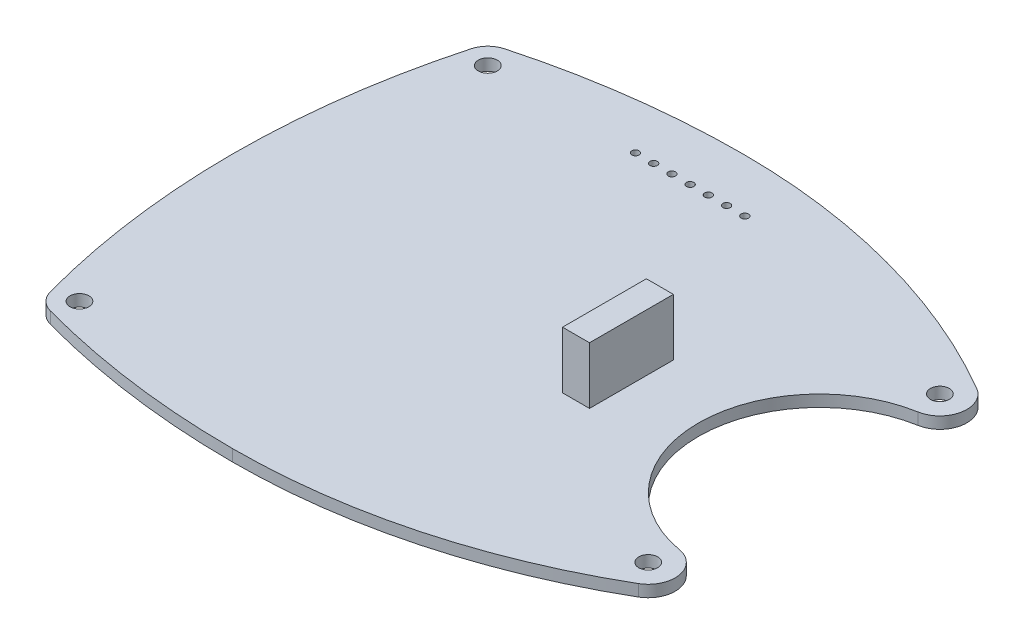
ISO-10303-21;
HEADER;
FILE_DESCRIPTION(('STEP AP214'),'2;1');
FILE_NAME('part.step','',(''),(''),'','','');
FILE_SCHEMA(('AUTOMOTIVE_DESIGN { 1 0 10303 214 1 1 1 1 }'));
ENDSEC;
DATA;
#1=APPLICATION_CONTEXT('core data for automotive mechanical design processes');
#2=APPLICATION_PROTOCOL_DEFINITION('international standard','automotive_design',2000,#1);
#3=PRODUCT_CONTEXT('',#1,'mechanical');
#4=PRODUCT('Part','Part','',(#3));
#5=PRODUCT_RELATED_PRODUCT_CATEGORY('part','',(#4));
#6=PRODUCT_DEFINITION_FORMATION('','',#4);
#7=PRODUCT_DEFINITION_CONTEXT('part definition',#1,'design');
#8=PRODUCT_DEFINITION('design','',#6,#7);
#9=PRODUCT_DEFINITION_SHAPE('','',#8);
#10=(LENGTH_UNIT() NAMED_UNIT(*) SI_UNIT(.MILLI.,.METRE.));
#11=(NAMED_UNIT(*) PLANE_ANGLE_UNIT() SI_UNIT($,.RADIAN.));
#12=(NAMED_UNIT(*) SI_UNIT($,.STERADIAN.) SOLID_ANGLE_UNIT());
#13=UNCERTAINTY_MEASURE_WITH_UNIT(LENGTH_MEASURE(1.E-05),#10,'distance_accuracy_value','');
#14=(GEOMETRIC_REPRESENTATION_CONTEXT(3) GLOBAL_UNCERTAINTY_ASSIGNED_CONTEXT((#13)) GLOBAL_UNIT_ASSIGNED_CONTEXT((#10,
#11,#12)) REPRESENTATION_CONTEXT('',''));
#15=CARTESIAN_POINT('',(0.,0.,0.));
#16=DIRECTION('',(0.,0.,1.));
#17=DIRECTION('',(1.,0.,0.));
#18=AXIS2_PLACEMENT_3D('',#15,#16,#17);
#19=CARTESIAN_POINT('',(0.,9.4,0.));
#20=DIRECTION('',(0.,-1.,0.));
#21=DIRECTION('',(0.,0.,-1.));
#22=AXIS2_PLACEMENT_3D('',#19,#20,#21);
#23=PLANE('',#22);
#24=DIRECTION('',(0.,0.,-1.));
#25=VECTOR('',#24,1.);
#26=CARTESIAN_POINT('',(16.,9.4,5.75));
#27=LINE('',#26,#25);
#28=CARTESIAN_POINT('',(16.,9.4,5.75));
#29=VERTEX_POINT('',#28);
#30=CARTESIAN_POINT('',(16.,9.4,-5.75));
#31=VERTEX_POINT('',#30);
#32=EDGE_CURVE('E215',#29,#31,#27,.T.);
#33=ORIENTED_EDGE('',*,*,#32,.F.);
#34=DIRECTION('',(-1.,0.,0.));
#35=VECTOR('',#34,1.);
#36=CARTESIAN_POINT('',(16.,9.4,5.75));
#37=LINE('',#36,#35);
#38=CARTESIAN_POINT('',(19.7,9.4,5.75));
#39=VERTEX_POINT('',#38);
#40=EDGE_CURVE('E220',#39,#29,#37,.T.);
#41=ORIENTED_EDGE('',*,*,#40,.F.);
#42=DIRECTION('',(0.,0.,1.));
#43=VECTOR('',#42,1.);
#44=CARTESIAN_POINT('',(19.7,9.4,5.75));
#45=LINE('',#44,#43);
#46=CARTESIAN_POINT('',(19.7,9.4,-5.75));
#47=VERTEX_POINT('',#46);
#48=EDGE_CURVE('E225',#47,#39,#45,.T.);
#49=ORIENTED_EDGE('',*,*,#48,.F.);
#50=DIRECTION('',(1.,0.,0.));
#51=VECTOR('',#50,1.);
#52=CARTESIAN_POINT('',(16.,9.4,-5.75));
#53=LINE('',#52,#51);
#54=EDGE_CURVE('E209',#31,#47,#53,.T.);
#55=ORIENTED_EDGE('',*,*,#54,.F.);
#56=EDGE_LOOP('',(#33,#41,#49,#55));
#57=FACE_BOUND('',#56,.T.);
#58=ADVANCED_FACE('F17',(#57),#23,.F.);
#59=CARTESIAN_POINT('',(0.,-3.,0.));
#60=DIRECTION('',(0.,1.,0.));
#61=DIRECTION('',(0.,0.,1.));
#62=AXIS2_PLACEMENT_3D('',#59,#60,#61);
#63=PLANE('',#62);
#64=DIRECTION('',(0.,0.,-1.));
#65=VECTOR('',#64,1.);
#66=CARTESIAN_POINT('',(11.002365618,-3.,-5.5));
#67=LINE('',#66,#65);
#68=CARTESIAN_POINT('',(11.002365618,-3.,-5.5));
#69=VERTEX_POINT('',#68);
#70=CARTESIAN_POINT('',(11.002365618,-3.,5.5));
#71=VERTEX_POINT('',#70);
#72=EDGE_CURVE('E166',#69,#71,#67,.F.);
#73=ORIENTED_EDGE('',*,*,#72,.F.);
#74=DIRECTION('',(1.,0.,0.));
#75=VECTOR('',#74,1.);
#76=CARTESIAN_POINT('',(11.002365618,-3.,-5.5));
#77=LINE('',#76,#75);
#78=CARTESIAN_POINT('',(16.002365618,-3.,-5.5));
#79=VERTEX_POINT('',#78);
#80=EDGE_CURVE('E178',#79,#69,#77,.F.);
#81=ORIENTED_EDGE('',*,*,#80,.F.);
#82=DIRECTION('',(0.,0.,1.));
#83=VECTOR('',#82,1.);
#84=CARTESIAN_POINT('',(16.002365618,-3.,-5.5));
#85=LINE('',#84,#83);
#86=CARTESIAN_POINT('',(16.002365618,-3.,5.5));
#87=VERTEX_POINT('',#86);
#88=EDGE_CURVE('E183',#87,#79,#85,.F.);
#89=ORIENTED_EDGE('',*,*,#88,.F.);
#90=DIRECTION('',(-1.,0.,0.));
#91=VECTOR('',#90,1.);
#92=CARTESIAN_POINT('',(11.002365618,-3.,5.5));
#93=LINE('',#92,#91);
#94=EDGE_CURVE('E149',#71,#87,#93,.F.);
#95=ORIENTED_EDGE('',*,*,#94,.F.);
#96=EDGE_LOOP('',(#73,#81,#89,#95));
#97=FACE_BOUND('',#96,.T.);
#98=ADVANCED_FACE('F473',(#97),#63,.F.);
#99=CARTESIAN_POINT('',(19.7,9.4,5.75));
#100=DIRECTION('',(-1.,0.,0.));
#101=DIRECTION('',(0.,0.,1.));
#102=AXIS2_PLACEMENT_3D('',#99,#100,#101);
#103=PLANE('',#102);
#104=ORIENTED_EDGE('',*,*,#48,.T.);
#105=DIRECTION('',(0.,1.,0.));
#106=VECTOR('',#105,1.);
#107=CARTESIAN_POINT('',(19.7,9.4,5.75));
#108=LINE('',#107,#106);
#109=CARTESIAN_POINT('',(19.7,1.6,5.75));
#110=VERTEX_POINT('',#109);
#111=EDGE_CURVE('E222',#110,#39,#108,.T.);
#112=ORIENTED_EDGE('',*,*,#111,.F.);
#113=DIRECTION('',(0.,0.,-1.));
#114=VECTOR('',#113,1.);
#115=CARTESIAN_POINT('',(19.7,1.6,-23.329166667));
#116=LINE('',#115,#114);
#117=CARTESIAN_POINT('',(19.7,1.6,-5.75));
#118=VERTEX_POINT('',#117);
#119=EDGE_CURVE('E174',#118,#110,#116,.F.);
#120=ORIENTED_EDGE('',*,*,#119,.F.);
#121=DIRECTION('',(0.,1.,0.));
#122=VECTOR('',#121,1.);
#123=CARTESIAN_POINT('',(19.7,9.4,-5.75));
#124=LINE('',#123,#122);
#125=EDGE_CURVE('E206',#47,#118,#124,.F.);
#126=ORIENTED_EDGE('',*,*,#125,.F.);
#127=EDGE_LOOP('',(#104,#112,#120,#126));
#128=FACE_BOUND('',#127,.T.);
#129=ADVANCED_FACE('F470',(#128),#103,.F.);
#130=CARTESIAN_POINT('',(16.,9.4,5.75));
#131=DIRECTION('',(0.,0.,-1.));
#132=DIRECTION('',(-1.,0.,0.));
#133=AXIS2_PLACEMENT_3D('',#130,#131,#132);
#134=PLANE('',#133);
#135=ORIENTED_EDGE('',*,*,#40,.T.);
#136=DIRECTION('',(0.,1.,0.));
#137=VECTOR('',#136,1.);
#138=CARTESIAN_POINT('',(16.,9.4,5.75));
#139=LINE('',#138,#137);
#140=CARTESIAN_POINT('',(16.,1.6,5.75));
#141=VERTEX_POINT('',#140);
#142=EDGE_CURVE('E217',#141,#29,#139,.T.);
#143=ORIENTED_EDGE('',*,*,#142,.F.);
#144=DIRECTION('',(1.,0.,0.));
#145=VECTOR('',#144,1.);
#146=CARTESIAN_POINT('',(-14.,1.6,5.75));
#147=LINE('',#146,#145);
#148=EDGE_CURVE('E498',#110,#141,#147,.F.);
#149=ORIENTED_EDGE('',*,*,#148,.F.);
#150=ORIENTED_EDGE('',*,*,#111,.T.);
#151=EDGE_LOOP('',(#135,#143,#149,#150));
#152=FACE_BOUND('',#151,.T.);
#153=ADVANCED_FACE('F466',(#152),#134,.F.);
#154=CARTESIAN_POINT('',(16.,9.4,5.75));
#155=DIRECTION('',(1.,0.,0.));
#156=DIRECTION('',(0.,0.,-1.));
#157=AXIS2_PLACEMENT_3D('',#154,#155,#156);
#158=PLANE('',#157);
#159=ORIENTED_EDGE('',*,*,#32,.T.);
#160=DIRECTION('',(0.,1.,0.));
#161=VECTOR('',#160,1.);
#162=CARTESIAN_POINT('',(16.,9.4,-5.75));
#163=LINE('',#162,#161);
#164=CARTESIAN_POINT('',(16.,1.6,-5.75));
#165=VERTEX_POINT('',#164);
#166=EDGE_CURVE('E212',#165,#31,#163,.T.);
#167=ORIENTED_EDGE('',*,*,#166,.F.);
#168=DIRECTION('',(0.,0.,-1.));
#169=VECTOR('',#168,1.);
#170=CARTESIAN_POINT('',(16.,1.6,-23.329166667));
#171=LINE('',#170,#169);
#172=EDGE_CURVE('E496',#141,#165,#171,.T.);
#173=ORIENTED_EDGE('',*,*,#172,.F.);
#174=ORIENTED_EDGE('',*,*,#142,.T.);
#175=EDGE_LOOP('',(#159,#167,#173,#174));
#176=FACE_BOUND('',#175,.T.);
#177=ADVANCED_FACE('F462',(#176),#158,.F.);
#178=CARTESIAN_POINT('',(16.,9.4,-5.75));
#179=DIRECTION('',(0.,0.,1.));
#180=DIRECTION('',(1.,0.,0.));
#181=AXIS2_PLACEMENT_3D('',#178,#179,#180);
#182=PLANE('',#181);
#183=ORIENTED_EDGE('',*,*,#54,.T.);
#184=ORIENTED_EDGE('',*,*,#125,.T.);
#185=DIRECTION('',(1.,0.,0.));
#186=VECTOR('',#185,1.);
#187=CARTESIAN_POINT('',(-14.,1.6,-5.75));
#188=LINE('',#187,#186);
#189=EDGE_CURVE('E288',#165,#118,#188,.T.);
#190=ORIENTED_EDGE('',*,*,#189,.F.);
#191=ORIENTED_EDGE('',*,*,#166,.T.);
#192=EDGE_LOOP('',(#183,#184,#190,#191));
#193=FACE_BOUND('',#192,.T.);
#194=ADVANCED_FACE('F459',(#193),#182,.F.);
#195=CARTESIAN_POINT('',(0.,0.,-74.658333333));
#196=DIRECTION('',(0.,-1.,0.));
#197=DIRECTION('',(0.,0.,-1.));
#198=AXIS2_PLACEMENT_3D('',#195,#196,#197);
#199=CYLINDRICAL_SURFACE('',#198,109.658333334);
#200=CARTESIAN_POINT('',(0.,1.6000000003412,-74.658333333));
#201=DIRECTION('',(0.,-1.,0.));
#202=DIRECTION('',(0.,0.,-1.));
#203=AXIS2_PLACEMENT_3D('',#200,#201,#202);
#204=CIRCLE('',#203,109.658333334);
#205=CARTESIAN_POINT('',(-28.8551961782056,1.60000000016539,31.1354647980793));
#206=VERTEX_POINT('',#205);
#207=CARTESIAN_POINT('',(0.,1.60000000036999,35.000000001));
#208=VERTEX_POINT('',#207);
#209=EDGE_CURVE('E20',#206,#208,#204,.F.);
#210=ORIENTED_EDGE('',*,*,#209,.F.);
#211=DIRECTION('',(0.,1.,0.));
#212=VECTOR('',#211,1.);
#213=CARTESIAN_POINT('',(-28.8551961779043,0.8,31.1354647976493));
#214=LINE('',#213,#212);
#215=CARTESIAN_POINT('',(-28.8551961780756,1.65387491573494E-10,31.1354647976026));
#216=VERTEX_POINT('',#215);
#217=EDGE_CURVE('E204',#216,#206,#214,.T.);
#218=ORIENTED_EDGE('',*,*,#217,.F.);
#219=CARTESIAN_POINT('',(0.,3.41196038436409E-10,-74.658333333));
#220=DIRECTION('',(0.,-1.,0.));
#221=DIRECTION('',(0.,0.,-1.));
#222=AXIS2_PLACEMENT_3D('',#219,#220,#221);
#223=CIRCLE('',#222,109.658333334);
#224=CARTESIAN_POINT('',(0.,3.69995575651017E-10,35.000000001));
#225=VERTEX_POINT('',#224);
#226=EDGE_CURVE('E145',#225,#216,#223,.T.);
#227=ORIENTED_EDGE('',*,*,#226,.F.);
#228=DIRECTION('',(0.,-1.,0.));
#229=VECTOR('',#228,1.);
#230=CARTESIAN_POINT('',(0.,0.8,35.000000001));
#231=LINE('',#230,#229);
#232=EDGE_CURVE('E141',#208,#225,#231,.T.);
#233=ORIENTED_EDGE('',*,*,#232,.F.);
#234=EDGE_LOOP('',(#210,#218,#227,#233));
#235=FACE_BOUND('',#234,.T.);
#236=ADVANCED_FACE('F143',(#235),#199,.T.);
#237=CARTESIAN_POINT('',(-28.,0.,28.));
#238=DIRECTION('',(0.,-1.,0.));
#239=DIRECTION('',(0.,0.,-1.));
#240=AXIS2_PLACEMENT_3D('',#237,#238,#239);
#241=CYLINDRICAL_SURFACE('',#240,3.25);
#242=CARTESIAN_POINT('',(-28.,1.6,28.));
#243=DIRECTION('',(0.,-1.,0.));
#244=DIRECTION('',(0.,0.,-1.));
#245=AXIS2_PLACEMENT_3D('',#242,#243,#244);
#246=CIRCLE('',#245,3.25);
#247=CARTESIAN_POINT('',(-31.1354647975969,1.6,28.855196178074));
#248=VERTEX_POINT('',#247);
#249=EDGE_CURVE('E163',#248,#206,#246,.F.);
#250=ORIENTED_EDGE('',*,*,#249,.F.);
#251=DIRECTION('',(0.,1.,0.));
#252=VECTOR('',#251,1.);
#253=CARTESIAN_POINT('',(-31.1354647976379,0.8,28.8551961779013));
#254=LINE('',#253,#252);
#255=CARTESIAN_POINT('',(-31.1354647975912,0.,28.8551961780725));
#256=VERTEX_POINT('',#255);
#257=EDGE_CURVE('E202',#256,#248,#254,.T.);
#258=ORIENTED_EDGE('',*,*,#257,.F.);
#259=CARTESIAN_POINT('',(-28.,0.,28.));
#260=DIRECTION('',(0.,-1.,0.));
#261=DIRECTION('',(0.,0.,-1.));
#262=AXIS2_PLACEMENT_3D('',#259,#260,#261);
#263=CIRCLE('',#262,3.25);
#264=EDGE_CURVE('E284',#216,#256,#263,.T.);
#265=ORIENTED_EDGE('',*,*,#264,.F.);
#266=ORIENTED_EDGE('',*,*,#217,.T.);
#267=EDGE_LOOP('',(#250,#258,#265,#266));
#268=FACE_BOUND('',#267,.T.);
#269=ADVANCED_FACE('F366',(#268),#241,.T.);
#270=CARTESIAN_POINT('',(74.658333333,0.,0.));
#271=DIRECTION('',(0.,-1.,0.));
#272=DIRECTION('',(0.,0.,-1.));
#273=AXIS2_PLACEMENT_3D('',#270,#271,#272);
#274=CYLINDRICAL_SURFACE('',#273,109.658333333);
#275=CARTESIAN_POINT('',(74.658333333,1.6,0.));
#276=DIRECTION('',(0.,-1.,0.));
#277=DIRECTION('',(0.,0.,-1.));
#278=AXIS2_PLACEMENT_3D('',#275,#276,#277);
#279=CIRCLE('',#278,109.658333333);
#280=CARTESIAN_POINT('',(-31.1354647975969,1.6,-28.855196178074));
#281=VERTEX_POINT('',#280);
#282=EDGE_CURVE('E320',#281,#248,#279,.F.);
#283=ORIENTED_EDGE('',*,*,#282,.F.);
#284=DIRECTION('',(0.,1.,0.));
#285=VECTOR('',#284,1.);
#286=CARTESIAN_POINT('',(-31.1354647976493,0.8,-28.8551961779043));
#287=LINE('',#286,#285);
#288=CARTESIAN_POINT('',(-31.1354647976026,0.,-28.8551961780756));
#289=VERTEX_POINT('',#288);
#290=EDGE_CURVE('E200',#289,#281,#287,.T.);
#291=ORIENTED_EDGE('',*,*,#290,.F.);
#292=CARTESIAN_POINT('',(74.658333333,0.,0.));
#293=DIRECTION('',(0.,-1.,0.));
#294=DIRECTION('',(0.,0.,-1.));
#295=AXIS2_PLACEMENT_3D('',#292,#293,#294);
#296=CIRCLE('',#295,109.658333333);
#297=EDGE_CURVE('E281',#256,#289,#296,.T.);
#298=ORIENTED_EDGE('',*,*,#297,.F.);
#299=ORIENTED_EDGE('',*,*,#257,.T.);
#300=EDGE_LOOP('',(#283,#291,#298,#299));
#301=FACE_BOUND('',#300,.T.);
#302=ADVANCED_FACE('F362',(#301),#274,.T.);
#303=CARTESIAN_POINT('',(-28.,0.,-28.));
#304=DIRECTION('',(0.,-1.,0.));
#305=DIRECTION('',(0.,0.,-1.));
#306=AXIS2_PLACEMENT_3D('',#303,#304,#305);
#307=CYLINDRICAL_SURFACE('',#306,3.25);
#308=CARTESIAN_POINT('',(-28.,1.6,-28.));
#309=DIRECTION('',(0.,-1.,0.));
#310=DIRECTION('',(0.,0.,-1.));
#311=AXIS2_PLACEMENT_3D('',#308,#309,#310);
#312=CIRCLE('',#311,3.25);
#313=CARTESIAN_POINT('',(-28.855196178074,1.59999999983844,-31.1354647975969));
#314=VERTEX_POINT('',#313);
#315=EDGE_CURVE('E322',#314,#281,#312,.F.);
#316=ORIENTED_EDGE('',*,*,#315,.F.);
#317=DIRECTION('',(0.,1.,0.));
#318=VECTOR('',#317,1.);
#319=CARTESIAN_POINT('',(-28.8551961779013,0.8,-31.1354647976379));
#320=LINE('',#319,#318);
#321=CARTESIAN_POINT('',(-28.8551961780725,-1.61557433145747E-10,-31.1354647975912));
#322=VERTEX_POINT('',#321);
#323=EDGE_CURVE('E198',#322,#314,#320,.T.);
#324=ORIENTED_EDGE('',*,*,#323,.F.);
#325=CARTESIAN_POINT('',(-28.,0.,-28.));
#326=DIRECTION('',(0.,-1.,0.));
#327=DIRECTION('',(0.,0.,-1.));
#328=AXIS2_PLACEMENT_3D('',#325,#326,#327);
#329=CIRCLE('',#328,3.25);
#330=EDGE_CURVE('E278',#289,#322,#329,.T.);
#331=ORIENTED_EDGE('',*,*,#330,.F.);
#332=ORIENTED_EDGE('',*,*,#290,.T.);
#333=EDGE_LOOP('',(#316,#324,#331,#332));
#334=FACE_BOUND('',#333,.T.);
#335=ADVANCED_FACE('F359',(#334),#307,.T.);
#336=CARTESIAN_POINT('',(0.,0.,74.658333333));
#337=DIRECTION('',(0.,-1.,0.));
#338=DIRECTION('',(0.,0.,-1.));
#339=AXIS2_PLACEMENT_3D('',#336,#337,#338);
#340=CYLINDRICAL_SURFACE('',#339,109.658333333);
#341=CARTESIAN_POINT('',(0.,1.5999999996667,74.658333333));
#342=DIRECTION('',(0.,-1.,0.));
#343=DIRECTION('',(0.,0.,-1.));
#344=AXIS2_PLACEMENT_3D('',#341,#342,#343);
#345=CIRCLE('',#344,109.658333333);
#346=CARTESIAN_POINT('',(0.,1.59999999961845,-35.));
#347=VERTEX_POINT('',#346);
#348=EDGE_CURVE('E325',#347,#314,#345,.F.);
#349=ORIENTED_EDGE('',*,*,#348,.F.);
#350=DIRECTION('',(0.,1.,0.));
#351=VECTOR('',#350,1.);
#352=CARTESIAN_POINT('',(0.,0.8,-35.));
#353=LINE('',#352,#351);
#354=CARTESIAN_POINT('',(0.,-3.81550445607022E-10,-35.));
#355=VERTEX_POINT('',#354);
#356=EDGE_CURVE('E196',#355,#347,#353,.T.);
#357=ORIENTED_EDGE('',*,*,#356,.F.);
#358=CARTESIAN_POINT('',(0.,-3.33294589843769E-10,74.658333333));
#359=DIRECTION('',(0.,-1.,0.));
#360=DIRECTION('',(0.,0.,-1.));
#361=AXIS2_PLACEMENT_3D('',#358,#359,#360);
#362=CIRCLE('',#361,109.658333333);
#363=EDGE_CURVE('E275',#322,#355,#362,.T.);
#364=ORIENTED_EDGE('',*,*,#363,.F.);
#365=ORIENTED_EDGE('',*,*,#323,.T.);
#366=EDGE_LOOP('',(#349,#357,#364,#365));
#367=FACE_BOUND('',#366,.T.);
#368=ADVANCED_FACE('F355',(#367),#340,.T.);
#369=CARTESIAN_POINT('',(0.,0.,52.389705882));
#370=DIRECTION('',(0.,-1.,0.));
#371=DIRECTION('',(0.,0.,-1.));
#372=AXIS2_PLACEMENT_3D('',#369,#370,#371);
#373=CYLINDRICAL_SURFACE('',#372,87.389705882);
#374=CARTESIAN_POINT('',(0.,1.5999999996471,52.389705882));
#375=DIRECTION('',(0.,-1.,0.));
#376=DIRECTION('',(0.,0.,-1.));
#377=AXIS2_PLACEMENT_3D('',#374,#375,#376);
#378=CIRCLE('',#377,87.389705882);
#379=CARTESIAN_POINT('',(43.8559116820076,1.59999999983135,-23.1987833522387));
#380=VERTEX_POINT('',#379);
#381=EDGE_CURVE('E328',#380,#347,#378,.F.);
#382=ORIENTED_EDGE('',*,*,#381,.F.);
#383=DIRECTION('',(0.,1.,0.));
#384=VECTOR('',#383,1.);
#385=CARTESIAN_POINT('',(43.855911682198,0.8,-23.1987833523412));
#386=LINE('',#385,#384);
#387=CARTESIAN_POINT('',(43.8559116821001,-1.68649853062362E-10,-23.198783352398));
#388=VERTEX_POINT('',#387);
#389=EDGE_CURVE('E194',#388,#380,#386,.T.);
#390=ORIENTED_EDGE('',*,*,#389,.F.);
#391=CARTESIAN_POINT('',(0.,-3.52893495675355E-10,52.389705882));
#392=DIRECTION('',(0.,-1.,0.));
#393=DIRECTION('',(0.,0.,-1.));
#394=AXIS2_PLACEMENT_3D('',#391,#392,#393);
#395=CIRCLE('',#394,87.389705882);
#396=EDGE_CURVE('E272',#355,#388,#395,.T.);
#397=ORIENTED_EDGE('',*,*,#396,.F.);
#398=ORIENTED_EDGE('',*,*,#356,.T.);
#399=EDGE_LOOP('',(#382,#390,#397,#398));
#400=FACE_BOUND('',#399,.T.);
#401=ADVANCED_FACE('F351',(#400),#373,.T.);
#402=CARTESIAN_POINT('',(42.,0.,-20.));
#403=DIRECTION('',(0.,-1.,0.));
#404=DIRECTION('',(0.,0.,-1.));
#405=AXIS2_PLACEMENT_3D('',#402,#403,#404);
#406=CYLINDRICAL_SURFACE('',#405,3.69819187);
#407=CARTESIAN_POINT('',(42.,1.6,-20.));
#408=DIRECTION('',(0.,-1.,0.));
#409=DIRECTION('',(0.,0.,-1.));
#410=AXIS2_PLACEMENT_3D('',#407,#408,#409);
#411=CIRCLE('',#410,3.69819187);
#412=CARTESIAN_POINT('',(42.6374955411872,1.6,-16.3571683350015));
#413=VERTEX_POINT('',#412);
#414=EDGE_CURVE('E331',#413,#380,#411,.F.);
#415=ORIENTED_EDGE('',*,*,#414,.F.);
#416=DIRECTION('',(0.,1.,0.));
#417=VECTOR('',#416,1.);
#418=CARTESIAN_POINT('',(42.6374955409404,0.8,-16.3571683353406));
#419=LINE('',#418,#417);
#420=CARTESIAN_POINT('',(42.6374955411223,0.,-16.3571683353724));
#421=VERTEX_POINT('',#420);
#422=EDGE_CURVE('E192',#421,#413,#419,.T.);
#423=ORIENTED_EDGE('',*,*,#422,.F.);
#424=CARTESIAN_POINT('',(42.,0.,-20.));
#425=DIRECTION('',(0.,-1.,0.));
#426=DIRECTION('',(0.,0.,-1.));
#427=AXIS2_PLACEMENT_3D('',#424,#425,#426);
#428=CIRCLE('',#427,3.69819187);
#429=EDGE_CURVE('E269',#388,#421,#428,.T.);
#430=ORIENTED_EDGE('',*,*,#429,.F.);
#431=ORIENTED_EDGE('',*,*,#389,.T.);
#432=EDGE_LOOP('',(#415,#423,#430,#431));
#433=FACE_BOUND('',#432,.T.);
#434=ADVANCED_FACE('F347',(#433),#406,.T.);
#435=CARTESIAN_POINT('',(45.5,1.6,0.));
#436=DIRECTION('',(0.,-1.,0.));
#437=DIRECTION('',(0.,0.,-1.));
#438=AXIS2_PLACEMENT_3D('',#435,#436,#437);
#439=CYLINDRICAL_SURFACE('',#438,16.605748635);
#440=CARTESIAN_POINT('',(45.5,1.6,0.));
#441=DIRECTION('',(0.,-1.,0.));
#442=DIRECTION('',(0.,0.,-1.));
#443=AXIS2_PLACEMENT_3D('',#440,#441,#442);
#444=CIRCLE('',#443,16.605748635);
#445=CARTESIAN_POINT('',(42.6374955411872,1.6,16.3571683350015));
#446=VERTEX_POINT('',#445);
#447=EDGE_CURVE('E334',#446,#413,#444,.T.);
#448=ORIENTED_EDGE('',*,*,#447,.F.);
#449=DIRECTION('',(0.,1.,0.));
#450=VECTOR('',#449,1.);
#451=CARTESIAN_POINT('',(42.6374955410702,0.8,16.3571683345988));
#452=LINE('',#451,#450);
#453=CARTESIAN_POINT('',(42.6374955412521,0.,16.3571683346306));
#454=VERTEX_POINT('',#453);
#455=EDGE_CURVE('E190',#454,#446,#452,.T.);
#456=ORIENTED_EDGE('',*,*,#455,.F.);
#457=CARTESIAN_POINT('',(45.5,0.,0.));
#458=DIRECTION('',(0.,-1.,0.));
#459=DIRECTION('',(0.,0.,-1.));
#460=AXIS2_PLACEMENT_3D('',#457,#458,#459);
#461=CIRCLE('',#460,16.605748635);
#462=EDGE_CURVE('E266',#421,#454,#461,.F.);
#463=ORIENTED_EDGE('',*,*,#462,.F.);
#464=ORIENTED_EDGE('',*,*,#422,.T.);
#465=EDGE_LOOP('',(#448,#456,#463,#464));
#466=FACE_BOUND('',#465,.T.);
#467=ADVANCED_FACE('F343',(#466),#439,.F.);
#468=CARTESIAN_POINT('',(42.,0.,20.));
#469=DIRECTION('',(0.,-1.,0.));
#470=DIRECTION('',(0.,0.,-1.));
#471=AXIS2_PLACEMENT_3D('',#468,#469,#470);
#472=CYLINDRICAL_SURFACE('',#471,3.69819187);
#473=CARTESIAN_POINT('',(42.,1.6,20.));
#474=DIRECTION('',(0.,-1.,0.));
#475=DIRECTION('',(0.,0.,-1.));
#476=AXIS2_PLACEMENT_3D('',#473,#474,#475);
#477=CIRCLE('',#476,3.69819187);
#478=CARTESIAN_POINT('',(43.8559116822585,1.60000000016865,23.1987833526711));
#479=VERTEX_POINT('',#478);
#480=EDGE_CURVE('E158',#479,#446,#477,.F.);
#481=ORIENTED_EDGE('',*,*,#480,.F.);
#482=DIRECTION('',(0.,1.,0.));
#483=VECTOR('',#482,1.);
#484=CARTESIAN_POINT('',(43.8559116825149,0.8,23.1987833528874));
#485=LINE('',#484,#483);
#486=CARTESIAN_POINT('',(43.855911682417,1.68649542173118E-10,23.1987833529442));
#487=VERTEX_POINT('',#486);
#488=EDGE_CURVE('E150',#487,#479,#485,.T.);
#489=ORIENTED_EDGE('',*,*,#488,.F.);
#490=CARTESIAN_POINT('',(42.,0.,20.));
#491=DIRECTION('',(0.,-1.,0.));
#492=DIRECTION('',(0.,0.,-1.));
#493=AXIS2_PLACEMENT_3D('',#490,#491,#492);
#494=CIRCLE('',#493,3.69819187);
#495=EDGE_CURVE('E263',#454,#487,#494,.T.);
#496=ORIENTED_EDGE('',*,*,#495,.F.);
#497=ORIENTED_EDGE('',*,*,#455,.T.);
#498=EDGE_LOOP('',(#481,#489,#496,#497));
#499=FACE_BOUND('',#498,.T.);
#500=ADVANCED_FACE('F339',(#499),#472,.T.);
#501=CARTESIAN_POINT('',(0.,0.,-52.389705882));
#502=DIRECTION('',(0.,-1.,0.));
#503=DIRECTION('',(0.,0.,-1.));
#504=AXIS2_PLACEMENT_3D('',#501,#502,#503);
#505=CYLINDRICAL_SURFACE('',#504,87.389705883);
#506=CARTESIAN_POINT('',(0.,1.6000000003529,-52.389705882));
#507=DIRECTION('',(0.,-1.,0.));
#508=DIRECTION('',(0.,0.,-1.));
#509=AXIS2_PLACEMENT_3D('',#506,#507,#508);
#510=CIRCLE('',#509,87.389705883);
#511=EDGE_CURVE('E153',#208,#479,#510,.F.);
#512=ORIENTED_EDGE('',*,*,#511,.F.);
#513=ORIENTED_EDGE('',*,*,#232,.T.);
#514=CARTESIAN_POINT('',(0.,3.52892845154051E-10,-52.389705882));
#515=DIRECTION('',(0.,-1.,0.));
#516=DIRECTION('',(0.,0.,-1.));
#517=AXIS2_PLACEMENT_3D('',#514,#515,#516);
#518=CIRCLE('',#517,87.389705883);
#519=EDGE_CURVE('E261',#487,#225,#518,.T.);
#520=ORIENTED_EDGE('',*,*,#519,.F.);
#521=ORIENTED_EDGE('',*,*,#488,.T.);
#522=EDGE_LOOP('',(#512,#513,#520,#521));
#523=FACE_BOUND('',#522,.T.);
#524=ADVANCED_FACE('F154',(#523),#505,.T.);
#525=CARTESIAN_POINT('',(5.,1.6,-27.75));
#526=DIRECTION('',(0.,-1.,0.));
#527=DIRECTION('',(0.,0.,-1.));
#528=AXIS2_PLACEMENT_3D('',#525,#526,#527);
#529=CYLINDRICAL_SURFACE('',#528,0.5);
#530=CARTESIAN_POINT('',(5.,0.,-27.75));
#531=DIRECTION('',(0.,-1.,0.));
#532=DIRECTION('',(0.,0.,-1.));
#533=AXIS2_PLACEMENT_3D('',#530,#531,#532);
#534=CIRCLE('',#533,0.5);
#535=CARTESIAN_POINT('',(5.,0.,-28.25));
#536=VERTEX_POINT('',#535);
#537=EDGE_CURVE('E258',#536,#536,#534,.F.);
#538=ORIENTED_EDGE('',*,*,#537,.F.);
#539=EDGE_LOOP('',(#538));
#540=FACE_BOUND('',#539,.T.);
#541=CARTESIAN_POINT('',(5.,1.6,-27.75));
#542=DIRECTION('',(0.,-1.,0.));
#543=DIRECTION('',(0.,0.,-1.));
#544=AXIS2_PLACEMENT_3D('',#541,#542,#543);
#545=CIRCLE('',#544,0.5);
#546=CARTESIAN_POINT('',(5.,1.6,-28.25));
#547=VERTEX_POINT('',#546);
#548=EDGE_CURVE('E316',#547,#547,#545,.T.);
#549=ORIENTED_EDGE('',*,*,#548,.F.);
#550=EDGE_LOOP('',(#549));
#551=FACE_BOUND('',#550,.T.);
#552=ADVANCED_FACE('F434',(#540,#551),#529,.F.);
#553=CARTESIAN_POINT('',(2.5,1.6,-27.75));
#554=DIRECTION('',(0.,-1.,0.));
#555=DIRECTION('',(0.,0.,-1.));
#556=AXIS2_PLACEMENT_3D('',#553,#554,#555);
#557=CYLINDRICAL_SURFACE('',#556,0.5);
#558=CARTESIAN_POINT('',(2.5,0.,-27.75));
#559=DIRECTION('',(0.,-1.,0.));
#560=DIRECTION('',(0.,0.,-1.));
#561=AXIS2_PLACEMENT_3D('',#558,#559,#560);
#562=CIRCLE('',#561,0.5);
#563=CARTESIAN_POINT('',(2.5,0.,-28.25));
#564=VERTEX_POINT('',#563);
#565=EDGE_CURVE('E255',#564,#564,#562,.F.);
#566=ORIENTED_EDGE('',*,*,#565,.F.);
#567=EDGE_LOOP('',(#566));
#568=FACE_BOUND('',#567,.T.);
#569=CARTESIAN_POINT('',(2.5,1.6,-27.75));
#570=DIRECTION('',(0.,-1.,0.));
#571=DIRECTION('',(0.,0.,-1.));
#572=AXIS2_PLACEMENT_3D('',#569,#570,#571);
#573=CIRCLE('',#572,0.5);
#574=CARTESIAN_POINT('',(2.5,1.6,-28.25));
#575=VERTEX_POINT('',#574);
#576=EDGE_CURVE('E313',#575,#575,#573,.T.);
#577=ORIENTED_EDGE('',*,*,#576,.F.);
#578=EDGE_LOOP('',(#577));
#579=FACE_BOUND('',#578,.T.);
#580=ADVANCED_FACE('F430',(#568,#579),#557,.F.);
#581=CARTESIAN_POINT('',(-7.5,1.6,-27.75));
#582=DIRECTION('',(0.,-1.,0.));
#583=DIRECTION('',(0.,0.,-1.));
#584=AXIS2_PLACEMENT_3D('',#581,#582,#583);
#585=CYLINDRICAL_SURFACE('',#584,0.5);
#586=CARTESIAN_POINT('',(-7.5,0.,-27.75));
#587=DIRECTION('',(0.,-1.,0.));
#588=DIRECTION('',(0.,0.,-1.));
#589=AXIS2_PLACEMENT_3D('',#586,#587,#588);
#590=CIRCLE('',#589,0.5);
#591=CARTESIAN_POINT('',(-7.5,0.,-28.25));
#592=VERTEX_POINT('',#591);
#593=EDGE_CURVE('E252',#592,#592,#590,.F.);
#594=ORIENTED_EDGE('',*,*,#593,.F.);
#595=EDGE_LOOP('',(#594));
#596=FACE_BOUND('',#595,.T.);
#597=CARTESIAN_POINT('',(-7.5,1.6,-27.75));
#598=DIRECTION('',(0.,-1.,0.));
#599=DIRECTION('',(0.,0.,-1.));
#600=AXIS2_PLACEMENT_3D('',#597,#598,#599);
#601=CIRCLE('',#600,0.5);
#602=CARTESIAN_POINT('',(-7.5,1.6,-28.25));
#603=VERTEX_POINT('',#602);
#604=EDGE_CURVE('E310',#603,#603,#601,.T.);
#605=ORIENTED_EDGE('',*,*,#604,.F.);
#606=EDGE_LOOP('',(#605));
#607=FACE_BOUND('',#606,.T.);
#608=ADVANCED_FACE('F426',(#596,#607),#585,.F.);
#609=CARTESIAN_POINT('',(-5.,1.6,-27.75));
#610=DIRECTION('',(0.,-1.,0.));
#611=DIRECTION('',(0.,0.,-1.));
#612=AXIS2_PLACEMENT_3D('',#609,#610,#611);
#613=CYLINDRICAL_SURFACE('',#612,0.5);
#614=CARTESIAN_POINT('',(-5.,0.,-27.75));
#615=DIRECTION('',(0.,-1.,0.));
#616=DIRECTION('',(0.,0.,-1.));
#617=AXIS2_PLACEMENT_3D('',#614,#615,#616);
#618=CIRCLE('',#617,0.5);
#619=CARTESIAN_POINT('',(-5.,0.,-28.25));
#620=VERTEX_POINT('',#619);
#621=EDGE_CURVE('E249',#620,#620,#618,.F.);
#622=ORIENTED_EDGE('',*,*,#621,.F.);
#623=EDGE_LOOP('',(#622));
#624=FACE_BOUND('',#623,.T.);
#625=CARTESIAN_POINT('',(-5.,1.6,-27.75));
#626=DIRECTION('',(0.,-1.,0.));
#627=DIRECTION('',(0.,0.,-1.));
#628=AXIS2_PLACEMENT_3D('',#625,#626,#627);
#629=CIRCLE('',#628,0.5);
#630=CARTESIAN_POINT('',(-5.,1.6,-28.25));
#631=VERTEX_POINT('',#630);
#632=EDGE_CURVE('E307',#631,#631,#629,.T.);
#633=ORIENTED_EDGE('',*,*,#632,.F.);
#634=EDGE_LOOP('',(#633));
#635=FACE_BOUND('',#634,.T.);
#636=ADVANCED_FACE('F422',(#624,#635),#613,.F.);
#637=CARTESIAN_POINT('',(-2.5,1.6,-27.75));
#638=DIRECTION('',(0.,-1.,0.));
#639=DIRECTION('',(0.,0.,-1.));
#640=AXIS2_PLACEMENT_3D('',#637,#638,#639);
#641=CYLINDRICAL_SURFACE('',#640,0.5);
#642=CARTESIAN_POINT('',(-2.5,0.,-27.75));
#643=DIRECTION('',(0.,-1.,0.));
#644=DIRECTION('',(0.,0.,-1.));
#645=AXIS2_PLACEMENT_3D('',#642,#643,#644);
#646=CIRCLE('',#645,0.5);
#647=CARTESIAN_POINT('',(-2.5,0.,-28.25));
#648=VERTEX_POINT('',#647);
#649=EDGE_CURVE('E246',#648,#648,#646,.F.);
#650=ORIENTED_EDGE('',*,*,#649,.F.);
#651=EDGE_LOOP('',(#650));
#652=FACE_BOUND('',#651,.T.);
#653=CARTESIAN_POINT('',(-2.5,1.6,-27.75));
#654=DIRECTION('',(0.,-1.,0.));
#655=DIRECTION('',(0.,0.,-1.));
#656=AXIS2_PLACEMENT_3D('',#653,#654,#655);
#657=CIRCLE('',#656,0.5);
#658=CARTESIAN_POINT('',(-2.5,1.6,-28.25));
#659=VERTEX_POINT('',#658);
#660=EDGE_CURVE('E304',#659,#659,#657,.T.);
#661=ORIENTED_EDGE('',*,*,#660,.F.);
#662=EDGE_LOOP('',(#661));
#663=FACE_BOUND('',#662,.T.);
#664=ADVANCED_FACE('F418',(#652,#663),#641,.F.);
#665=CARTESIAN_POINT('',(0.,1.6,-27.75));
#666=DIRECTION('',(0.,-1.,0.));
#667=DIRECTION('',(0.,0.,-1.));
#668=AXIS2_PLACEMENT_3D('',#665,#666,#667);
#669=CYLINDRICAL_SURFACE('',#668,0.5);
#670=CARTESIAN_POINT('',(0.,0.,-27.75));
#671=DIRECTION('',(0.,-1.,0.));
#672=DIRECTION('',(0.,0.,-1.));
#673=AXIS2_PLACEMENT_3D('',#670,#671,#672);
#674=CIRCLE('',#673,0.5);
#675=CARTESIAN_POINT('',(0.,0.,-28.25));
#676=VERTEX_POINT('',#675);
#677=EDGE_CURVE('E243',#676,#676,#674,.F.);
#678=ORIENTED_EDGE('',*,*,#677,.F.);
#679=EDGE_LOOP('',(#678));
#680=FACE_BOUND('',#679,.T.);
#681=CARTESIAN_POINT('',(0.,1.6,-27.75));
#682=DIRECTION('',(0.,-1.,0.));
#683=DIRECTION('',(0.,0.,-1.));
#684=AXIS2_PLACEMENT_3D('',#681,#682,#683);
#685=CIRCLE('',#684,0.5);
#686=CARTESIAN_POINT('',(0.,1.6,-28.25));
#687=VERTEX_POINT('',#686);
#688=EDGE_CURVE('E301',#687,#687,#685,.T.);
#689=ORIENTED_EDGE('',*,*,#688,.F.);
#690=EDGE_LOOP('',(#689));
#691=FACE_BOUND('',#690,.T.);
#692=ADVANCED_FACE('F414',(#680,#691),#669,.F.);
#693=CARTESIAN_POINT('',(42.,1.6,-20.));
#694=DIRECTION('',(0.,-1.,0.));
#695=DIRECTION('',(0.,0.,-1.));
#696=AXIS2_PLACEMENT_3D('',#693,#694,#695);
#697=CYLINDRICAL_SURFACE('',#696,1.3);
#698=CARTESIAN_POINT('',(42.,1.6,-20.));
#699=DIRECTION('',(0.,-1.,0.));
#700=DIRECTION('',(0.,0.,-1.));
#701=AXIS2_PLACEMENT_3D('',#698,#699,#700);
#702=CIRCLE('',#701,1.3);
#703=CARTESIAN_POINT('',(42.,1.6,-21.3));
#704=VERTEX_POINT('',#703);
#705=EDGE_CURVE('E289',#704,#704,#702,.T.);
#706=ORIENTED_EDGE('',*,*,#705,.F.);
#707=EDGE_LOOP('',(#706));
#708=FACE_BOUND('',#707,.T.);
#709=CARTESIAN_POINT('',(42.,0.,-20.));
#710=DIRECTION('',(0.,-1.,0.));
#711=DIRECTION('',(0.,0.,-1.));
#712=AXIS2_PLACEMENT_3D('',#709,#710,#711);
#713=CIRCLE('',#712,1.3);
#714=CARTESIAN_POINT('',(42.,0.,-21.3));
#715=VERTEX_POINT('',#714);
#716=EDGE_CURVE('E240',#715,#715,#713,.F.);
#717=ORIENTED_EDGE('',*,*,#716,.F.);
#718=EDGE_LOOP('',(#717));
#719=FACE_BOUND('',#718,.T.);
#720=ADVANCED_FACE('F410',(#708,#719),#697,.F.);
#721=CARTESIAN_POINT('',(-28.,1.6,-28.));
#722=DIRECTION('',(0.,-1.,0.));
#723=DIRECTION('',(0.,0.,-1.));
#724=AXIS2_PLACEMENT_3D('',#721,#722,#723);
#725=CYLINDRICAL_SURFACE('',#724,1.3);
#726=CARTESIAN_POINT('',(-28.,1.6,-28.));
#727=DIRECTION('',(0.,-1.,0.));
#728=DIRECTION('',(0.,0.,-1.));
#729=AXIS2_PLACEMENT_3D('',#726,#727,#728);
#730=CIRCLE('',#729,1.3);
#731=CARTESIAN_POINT('',(-28.,1.6,-29.3));
#732=VERTEX_POINT('',#731);
#733=EDGE_CURVE('E292',#732,#732,#730,.T.);
#734=ORIENTED_EDGE('',*,*,#733,.F.);
#735=EDGE_LOOP('',(#734));
#736=FACE_BOUND('',#735,.T.);
#737=CARTESIAN_POINT('',(-28.,0.,-28.));
#738=DIRECTION('',(0.,-1.,0.));
#739=DIRECTION('',(0.,0.,-1.));
#740=AXIS2_PLACEMENT_3D('',#737,#738,#739);
#741=CIRCLE('',#740,1.3);
#742=CARTESIAN_POINT('',(-28.,0.,-29.3));
#743=VERTEX_POINT('',#742);
#744=EDGE_CURVE('E237',#743,#743,#741,.F.);
#745=ORIENTED_EDGE('',*,*,#744,.F.);
#746=EDGE_LOOP('',(#745));
#747=FACE_BOUND('',#746,.T.);
#748=ADVANCED_FACE('F406',(#736,#747),#725,.F.);
#749=CARTESIAN_POINT('',(-28.,1.6,28.));
#750=DIRECTION('',(0.,-1.,0.));
#751=DIRECTION('',(0.,0.,-1.));
#752=AXIS2_PLACEMENT_3D('',#749,#750,#751);
#753=CYLINDRICAL_SURFACE('',#752,1.3);
#754=CARTESIAN_POINT('',(-28.,1.6,28.));
#755=DIRECTION('',(0.,-1.,0.));
#756=DIRECTION('',(0.,0.,-1.));
#757=AXIS2_PLACEMENT_3D('',#754,#755,#756);
#758=CIRCLE('',#757,1.3);
#759=CARTESIAN_POINT('',(-28.,1.6,26.7));
#760=VERTEX_POINT('',#759);
#761=EDGE_CURVE('E295',#760,#760,#758,.T.);
#762=ORIENTED_EDGE('',*,*,#761,.F.);
#763=EDGE_LOOP('',(#762));
#764=FACE_BOUND('',#763,.T.);
#765=CARTESIAN_POINT('',(-28.,0.,28.));
#766=DIRECTION('',(0.,-1.,0.));
#767=DIRECTION('',(0.,0.,-1.));
#768=AXIS2_PLACEMENT_3D('',#765,#766,#767);
#769=CIRCLE('',#768,1.3);
#770=CARTESIAN_POINT('',(-28.,0.,26.7));
#771=VERTEX_POINT('',#770);
#772=EDGE_CURVE('E234',#771,#771,#769,.F.);
#773=ORIENTED_EDGE('',*,*,#772,.F.);
#774=EDGE_LOOP('',(#773));
#775=FACE_BOUND('',#774,.T.);
#776=ADVANCED_FACE('F402',(#764,#775),#753,.F.);
#777=CARTESIAN_POINT('',(42.,1.6,20.));
#778=DIRECTION('',(0.,-1.,0.));
#779=DIRECTION('',(0.,0.,-1.));
#780=AXIS2_PLACEMENT_3D('',#777,#778,#779);
#781=CYLINDRICAL_SURFACE('',#780,1.3);
#782=CARTESIAN_POINT('',(42.,1.6,20.));
#783=DIRECTION('',(0.,-1.,0.));
#784=DIRECTION('',(0.,0.,-1.));
#785=AXIS2_PLACEMENT_3D('',#782,#783,#784);
#786=CIRCLE('',#785,1.3);
#787=CARTESIAN_POINT('',(42.,1.6,18.7));
#788=VERTEX_POINT('',#787);
#789=EDGE_CURVE('E298',#788,#788,#786,.T.);
#790=ORIENTED_EDGE('',*,*,#789,.F.);
#791=EDGE_LOOP('',(#790));
#792=FACE_BOUND('',#791,.T.);
#793=CARTESIAN_POINT('',(42.,0.,20.));
#794=DIRECTION('',(0.,-1.,0.));
#795=DIRECTION('',(0.,0.,-1.));
#796=AXIS2_PLACEMENT_3D('',#793,#794,#795);
#797=CIRCLE('',#796,1.3);
#798=CARTESIAN_POINT('',(42.,0.,18.7));
#799=VERTEX_POINT('',#798);
#800=EDGE_CURVE('E230',#799,#799,#797,.F.);
#801=ORIENTED_EDGE('',*,*,#800,.F.);
#802=EDGE_LOOP('',(#801));
#803=FACE_BOUND('',#802,.T.);
#804=ADVANCED_FACE('F398',(#792,#803),#781,.F.);
#805=CARTESIAN_POINT('',(11.002365618,-3.,5.5));
#806=DIRECTION('',(0.,0.,-1.));
#807=DIRECTION('',(-1.,0.,0.));
#808=AXIS2_PLACEMENT_3D('',#805,#806,#807);
#809=PLANE('',#808);
#810=ORIENTED_EDGE('',*,*,#94,.T.);
#811=DIRECTION('',(0.,1.,0.));
#812=VECTOR('',#811,1.);
#813=CARTESIAN_POINT('',(16.002365618,-3.,5.5));
#814=LINE('',#813,#812);
#815=CARTESIAN_POINT('',(16.002365618,0.,5.5));
#816=VERTEX_POINT('',#815);
#817=EDGE_CURVE('E185',#816,#87,#814,.F.);
#818=ORIENTED_EDGE('',*,*,#817,.F.);
#819=DIRECTION('',(1.,0.,0.));
#820=VECTOR('',#819,1.);
#821=CARTESIAN_POINT('',(-14.,0.,5.5));
#822=LINE('',#821,#820);
#823=CARTESIAN_POINT('',(11.002365618,0.,5.5));
#824=VERTEX_POINT('',#823);
#825=EDGE_CURVE('E233',#824,#816,#822,.T.);
#826=ORIENTED_EDGE('',*,*,#825,.F.);
#827=DIRECTION('',(0.,1.,0.));
#828=VECTOR('',#827,1.);
#829=CARTESIAN_POINT('',(11.002365618,-3.,5.5));
#830=LINE('',#829,#828);
#831=EDGE_CURVE('E164',#71,#824,#830,.T.);
#832=ORIENTED_EDGE('',*,*,#831,.F.);
#833=EDGE_LOOP('',(#810,#818,#826,#832));
#834=FACE_BOUND('',#833,.T.);
#835=ADVANCED_FACE('F394',(#834),#809,.F.);
#836=CARTESIAN_POINT('',(16.002365618,-3.,-5.5));
#837=DIRECTION('',(-1.,0.,0.));
#838=DIRECTION('',(0.,0.,1.));
#839=AXIS2_PLACEMENT_3D('',#836,#837,#838);
#840=PLANE('',#839);
#841=ORIENTED_EDGE('',*,*,#88,.T.);
#842=DIRECTION('',(0.,1.,0.));
#843=VECTOR('',#842,1.);
#844=CARTESIAN_POINT('',(16.002365618,-3.,-5.5));
#845=LINE('',#844,#843);
#846=CARTESIAN_POINT('',(16.002365618,0.,-5.5));
#847=VERTEX_POINT('',#846);
#848=EDGE_CURVE('E180',#847,#79,#845,.F.);
#849=ORIENTED_EDGE('',*,*,#848,.F.);
#850=DIRECTION('',(0.,0.,-1.));
#851=VECTOR('',#850,1.);
#852=CARTESIAN_POINT('',(16.002365618,0.,-23.329166667));
#853=LINE('',#852,#851);
#854=EDGE_CURVE('E489',#816,#847,#853,.T.);
#855=ORIENTED_EDGE('',*,*,#854,.F.);
#856=ORIENTED_EDGE('',*,*,#817,.T.);
#857=EDGE_LOOP('',(#841,#849,#855,#856));
#858=FACE_BOUND('',#857,.T.);
#859=ADVANCED_FACE('F391',(#858),#840,.F.);
#860=CARTESIAN_POINT('',(11.002365618,-3.,-5.5));
#861=DIRECTION('',(0.,0.,1.));
#862=DIRECTION('',(1.,0.,0.));
#863=AXIS2_PLACEMENT_3D('',#860,#861,#862);
#864=PLANE('',#863);
#865=ORIENTED_EDGE('',*,*,#80,.T.);
#866=DIRECTION('',(0.,1.,0.));
#867=VECTOR('',#866,1.);
#868=CARTESIAN_POINT('',(11.002365618,-3.,-5.5));
#869=LINE('',#868,#867);
#870=CARTESIAN_POINT('',(11.002365618,0.,-5.5));
#871=VERTEX_POINT('',#870);
#872=EDGE_CURVE('E35',#871,#69,#869,.F.);
#873=ORIENTED_EDGE('',*,*,#872,.F.);
#874=DIRECTION('',(1.,0.,0.));
#875=VECTOR('',#874,1.);
#876=CARTESIAN_POINT('',(-14.,0.,-5.5));
#877=LINE('',#876,#875);
#878=EDGE_CURVE('E485',#847,#871,#877,.F.);
#879=ORIENTED_EDGE('',*,*,#878,.F.);
#880=ORIENTED_EDGE('',*,*,#848,.T.);
#881=EDGE_LOOP('',(#865,#873,#879,#880));
#882=FACE_BOUND('',#881,.T.);
#883=ADVANCED_FACE('F388',(#882),#864,.F.);
#884=CARTESIAN_POINT('',(11.002365618,-3.,-5.5));
#885=DIRECTION('',(1.,0.,0.));
#886=DIRECTION('',(0.,0.,-1.));
#887=AXIS2_PLACEMENT_3D('',#884,#885,#886);
#888=PLANE('',#887);
#889=ORIENTED_EDGE('',*,*,#72,.T.);
#890=ORIENTED_EDGE('',*,*,#831,.T.);
#891=DIRECTION('',(0.,0.,-1.));
#892=VECTOR('',#891,1.);
#893=CARTESIAN_POINT('',(11.002365618,0.,-23.329166667));
#894=LINE('',#893,#892);
#895=EDGE_CURVE('E229',#871,#824,#894,.F.);
#896=ORIENTED_EDGE('',*,*,#895,.F.);
#897=ORIENTED_EDGE('',*,*,#872,.T.);
#898=EDGE_LOOP('',(#889,#890,#896,#897));
#899=FACE_BOUND('',#898,.T.);
#900=ADVANCED_FACE('F380',(#899),#888,.F.);
#901=CARTESIAN_POINT('',(-14.,1.6,-23.329166667));
#902=DIRECTION('',(0.,-1.,0.));
#903=DIRECTION('',(0.,0.,-1.));
#904=AXIS2_PLACEMENT_3D('',#901,#902,#903);
#905=PLANE('',#904);
#906=ORIENTED_EDGE('',*,*,#172,.T.);
#907=ORIENTED_EDGE('',*,*,#189,.T.);
#908=ORIENTED_EDGE('',*,*,#119,.T.);
#909=ORIENTED_EDGE('',*,*,#148,.T.);
#910=EDGE_LOOP('',(#906,#907,#908,#909));
#911=FACE_BOUND('',#910,.T.);
#912=ORIENTED_EDGE('',*,*,#705,.T.);
#913=EDGE_LOOP('',(#912));
#914=FACE_BOUND('',#913,.T.);
#915=ORIENTED_EDGE('',*,*,#733,.T.);
#916=EDGE_LOOP('',(#915));
#917=FACE_BOUND('',#916,.T.);
#918=ORIENTED_EDGE('',*,*,#761,.T.);
#919=EDGE_LOOP('',(#918));
#920=FACE_BOUND('',#919,.T.);
#921=ORIENTED_EDGE('',*,*,#789,.T.);
#922=EDGE_LOOP('',(#921));
#923=FACE_BOUND('',#922,.T.);
#924=ORIENTED_EDGE('',*,*,#688,.T.);
#925=EDGE_LOOP('',(#924));
#926=FACE_BOUND('',#925,.T.);
#927=ORIENTED_EDGE('',*,*,#660,.T.);
#928=EDGE_LOOP('',(#927));
#929=FACE_BOUND('',#928,.T.);
#930=ORIENTED_EDGE('',*,*,#632,.T.);
#931=EDGE_LOOP('',(#930));
#932=FACE_BOUND('',#931,.T.);
#933=ORIENTED_EDGE('',*,*,#604,.T.);
#934=EDGE_LOOP('',(#933));
#935=FACE_BOUND('',#934,.T.);
#936=ORIENTED_EDGE('',*,*,#576,.T.);
#937=EDGE_LOOP('',(#936));
#938=FACE_BOUND('',#937,.T.);
#939=ORIENTED_EDGE('',*,*,#548,.T.);
#940=EDGE_LOOP('',(#939));
#941=FACE_BOUND('',#940,.T.);
#942=CARTESIAN_POINT('',(7.5,1.6,-27.75));
#943=DIRECTION('',(0.,-1.,0.));
#944=DIRECTION('',(0.,0.,-1.));
#945=AXIS2_PLACEMENT_3D('',#942,#943,#944);
#946=CIRCLE('',#945,0.5);
#947=CARTESIAN_POINT('',(7.5,1.6,-28.25));
#948=VERTEX_POINT('',#947);
#949=EDGE_CURVE('E26',#948,#948,#946,.F.);
#950=ORIENTED_EDGE('',*,*,#949,.F.);
#951=EDGE_LOOP('',(#950));
#952=FACE_BOUND('',#951,.T.);
#953=ORIENTED_EDGE('',*,*,#282,.T.);
#954=ORIENTED_EDGE('',*,*,#249,.T.);
#955=ORIENTED_EDGE('',*,*,#209,.T.);
#956=ORIENTED_EDGE('',*,*,#511,.T.);
#957=ORIENTED_EDGE('',*,*,#480,.T.);
#958=ORIENTED_EDGE('',*,*,#447,.T.);
#959=ORIENTED_EDGE('',*,*,#414,.T.);
#960=ORIENTED_EDGE('',*,*,#381,.T.);
#961=ORIENTED_EDGE('',*,*,#348,.T.);
#962=ORIENTED_EDGE('',*,*,#315,.T.);
#963=EDGE_LOOP('',(#953,#954,#955,#956,#957,#958,#959,#960,#961,#962));
#964=FACE_BOUND('',#963,.T.);
#965=ADVANCED_FACE('F161',(#911,#914,#917,#920,#923,#926,#929,#932,#935,#938,#941,#952,#964),
#905,.F.);
#966=CARTESIAN_POINT('',(-14.,0.,-23.329166667));
#967=DIRECTION('',(0.,-1.,0.));
#968=DIRECTION('',(0.,0.,-1.));
#969=AXIS2_PLACEMENT_3D('',#966,#967,#968);
#970=PLANE('',#969);
#971=ORIENTED_EDGE('',*,*,#878,.T.);
#972=ORIENTED_EDGE('',*,*,#895,.T.);
#973=ORIENTED_EDGE('',*,*,#825,.T.);
#974=ORIENTED_EDGE('',*,*,#854,.T.);
#975=EDGE_LOOP('',(#971,#972,#973,#974));
#976=FACE_BOUND('',#975,.T.);
#977=ORIENTED_EDGE('',*,*,#800,.T.);
#978=EDGE_LOOP('',(#977));
#979=FACE_BOUND('',#978,.T.);
#980=ORIENTED_EDGE('',*,*,#772,.T.);
#981=EDGE_LOOP('',(#980));
#982=FACE_BOUND('',#981,.T.);
#983=ORIENTED_EDGE('',*,*,#744,.T.);
#984=EDGE_LOOP('',(#983));
#985=FACE_BOUND('',#984,.T.);
#986=ORIENTED_EDGE('',*,*,#716,.T.);
#987=EDGE_LOOP('',(#986));
#988=FACE_BOUND('',#987,.T.);
#989=ORIENTED_EDGE('',*,*,#677,.T.);
#990=EDGE_LOOP('',(#989));
#991=FACE_BOUND('',#990,.T.);
#992=ORIENTED_EDGE('',*,*,#649,.T.);
#993=EDGE_LOOP('',(#992));
#994=FACE_BOUND('',#993,.T.);
#995=ORIENTED_EDGE('',*,*,#621,.T.);
#996=EDGE_LOOP('',(#995));
#997=FACE_BOUND('',#996,.T.);
#998=ORIENTED_EDGE('',*,*,#593,.T.);
#999=EDGE_LOOP('',(#998));
#1000=FACE_BOUND('',#999,.T.);
#1001=ORIENTED_EDGE('',*,*,#565,.T.);
#1002=EDGE_LOOP('',(#1001));
#1003=FACE_BOUND('',#1002,.T.);
#1004=ORIENTED_EDGE('',*,*,#537,.T.);
#1005=EDGE_LOOP('',(#1004));
#1006=FACE_BOUND('',#1005,.T.);
#1007=CARTESIAN_POINT('',(7.5,0.,-27.75));
#1008=DIRECTION('',(0.,-1.,0.));
#1009=DIRECTION('',(0.,0.,-1.));
#1010=AXIS2_PLACEMENT_3D('',#1007,#1008,#1009);
#1011=CIRCLE('',#1010,0.5);
#1012=CARTESIAN_POINT('',(7.5,0.,-28.25));
#1013=VERTEX_POINT('',#1012);
#1014=EDGE_CURVE('E11',#1013,#1013,#1011,.T.);
#1015=ORIENTED_EDGE('',*,*,#1014,.F.);
#1016=EDGE_LOOP('',(#1015));
#1017=FACE_BOUND('',#1016,.T.);
#1018=ORIENTED_EDGE('',*,*,#495,.T.);
#1019=ORIENTED_EDGE('',*,*,#519,.T.);
#1020=ORIENTED_EDGE('',*,*,#226,.T.);
#1021=ORIENTED_EDGE('',*,*,#264,.T.);
#1022=ORIENTED_EDGE('',*,*,#297,.T.);
#1023=ORIENTED_EDGE('',*,*,#330,.T.);
#1024=ORIENTED_EDGE('',*,*,#363,.T.);
#1025=ORIENTED_EDGE('',*,*,#396,.T.);
#1026=ORIENTED_EDGE('',*,*,#429,.T.);
#1027=ORIENTED_EDGE('',*,*,#462,.T.);
#1028=EDGE_LOOP('',(#1018,#1019,#1020,#1021,#1022,#1023,#1024,#1025,#1026,#1027));
#1029=FACE_BOUND('',#1028,.T.);
#1030=ADVANCED_FACE('F368',(#976,#979,#982,#985,#988,#991,#994,#997,#1000,#1003,#1006,#1017,
#1029),#970,.T.);
#1031=CARTESIAN_POINT('',(7.5,1.6,-27.75));
#1032=DIRECTION('',(0.,-1.,0.));
#1033=DIRECTION('',(0.,0.,-1.));
#1034=AXIS2_PLACEMENT_3D('',#1031,#1032,#1033);
#1035=CYLINDRICAL_SURFACE('',#1034,0.5);
#1036=ORIENTED_EDGE('',*,*,#1014,.T.);
#1037=EDGE_LOOP('',(#1036));
#1038=FACE_BOUND('',#1037,.T.);
#1039=ORIENTED_EDGE('',*,*,#949,.T.);
#1040=EDGE_LOOP('',(#1039));
#1041=FACE_BOUND('',#1040,.T.);
#1042=ADVANCED_FACE('F370',(#1038,#1041),#1035,.F.);
#1043=CLOSED_SHELL('',(#58,#98,#129,#153,#177,#194,#236,#269,#302,#335,#368,#401,#434,#467,#500,
#524,#552,#580,#608,#636,#664,#692,#720,#748,#776,#804,#835,#859,#883,#900,#965,#1030,#1042));
#1044=MANIFOLD_SOLID_BREP('B1',#1043);
#1045=ADVANCED_BREP_SHAPE_REPRESENTATION('',(#18,#1044),#14);
#1046=SHAPE_DEFINITION_REPRESENTATION(#9,#1045);
ENDSEC;
END-ISO-10303-21;
